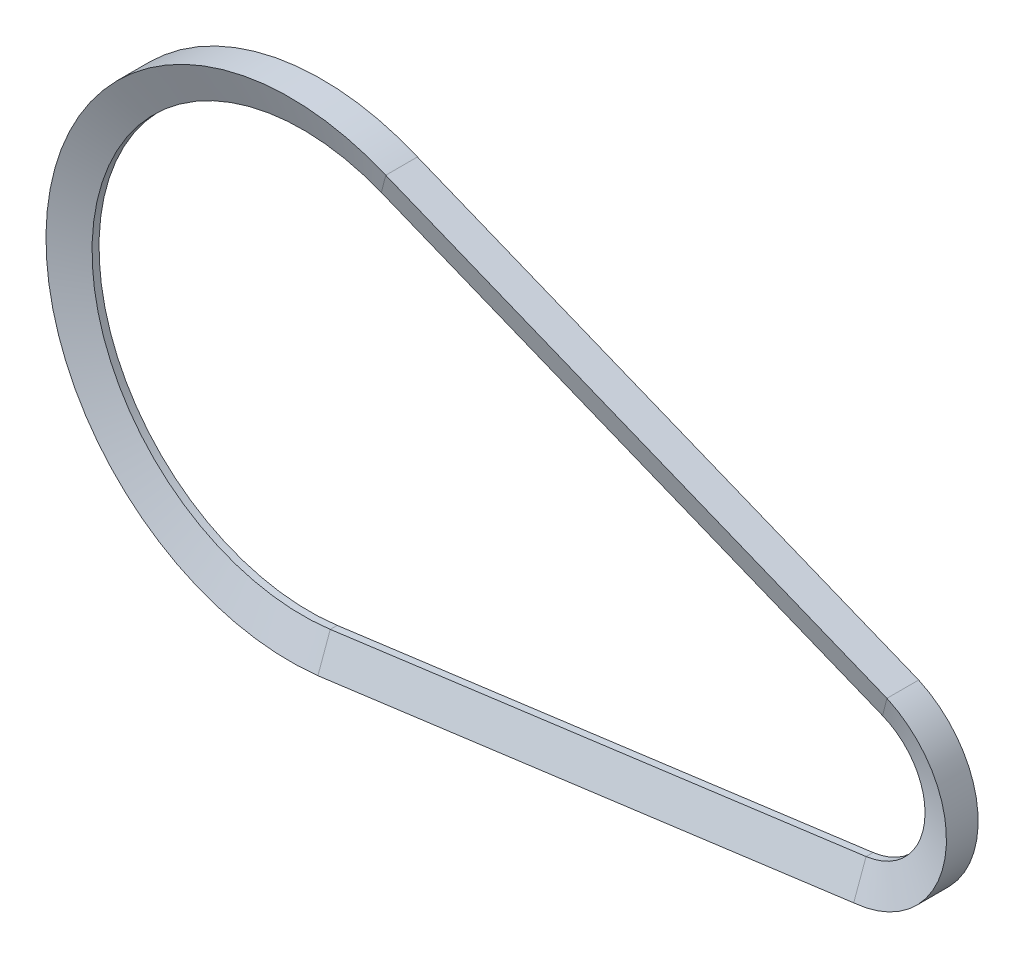
ISO-10303-21;
HEADER;
FILE_DESCRIPTION(('STEP AP214'),'2;1');
FILE_NAME('part.step','',(''),(''),'','','');
FILE_SCHEMA(('AUTOMOTIVE_DESIGN { 1 0 10303 214 1 1 1 1 }'));
ENDSEC;
DATA;
#1=APPLICATION_CONTEXT('core data for automotive mechanical design processes');
#2=APPLICATION_PROTOCOL_DEFINITION('international standard','automotive_design',2000,#1);
#3=PRODUCT_CONTEXT('',#1,'mechanical');
#4=PRODUCT('Part','Part','',(#3));
#5=PRODUCT_RELATED_PRODUCT_CATEGORY('part','',(#4));
#6=PRODUCT_DEFINITION_FORMATION('','',#4);
#7=PRODUCT_DEFINITION_CONTEXT('part definition',#1,'design');
#8=PRODUCT_DEFINITION('design','',#6,#7);
#9=PRODUCT_DEFINITION_SHAPE('','',#8);
#10=(LENGTH_UNIT() NAMED_UNIT(*) SI_UNIT(.MILLI.,.METRE.));
#11=(NAMED_UNIT(*) PLANE_ANGLE_UNIT() SI_UNIT($,.RADIAN.));
#12=(NAMED_UNIT(*) SI_UNIT($,.STERADIAN.) SOLID_ANGLE_UNIT());
#13=UNCERTAINTY_MEASURE_WITH_UNIT(LENGTH_MEASURE(1.E-05),#10,'distance_accuracy_value','');
#14=(GEOMETRIC_REPRESENTATION_CONTEXT(3) GLOBAL_UNCERTAINTY_ASSIGNED_CONTEXT((#13)) GLOBAL_UNIT_ASSIGNED_CONTEXT((#10,
#11,#12)) REPRESENTATION_CONTEXT('',''));
#15=CARTESIAN_POINT('',(0.,0.,0.));
#16=DIRECTION('',(0.,0.,1.));
#17=DIRECTION('',(1.,0.,0.));
#18=AXIS2_PLACEMENT_3D('',#15,#16,#17);
#19=CARTESIAN_POINT('',(124.475719306739,-30.3693151564213,0.770223243003508));
#20=DIRECTION('',(0.0453981297575215,-0.341667511459933,-0.93872377269743));
#21=DIRECTION('',(0.,0.93969262078591,-0.342020143325666));
#22=AXIS2_PLACEMENT_3D('',#19,#20,#21);
#23=PLANE('',#22);
#24=DIRECTION('',(0.,-0.939692620785909,0.342020143325666));
#25=VECTOR('',#24,1.);
#26=CARTESIAN_POINT('',(124.475719306739,-30.3693151564213,0.770223243003508));
#27=LINE('',#26,#25);
#28=CARTESIAN_POINT('',(124.475719306739,-30.3693151564213,0.770223243003508));
#29=VERTEX_POINT('',#28);
#30=CARTESIAN_POINT('',(124.475719306739,-37.8693151564213,3.5));
#31=VERTEX_POINT('',#30);
#32=EDGE_CURVE('E150',#29,#31,#27,.T.);
#33=ORIENTED_EDGE('',*,*,#32,.F.);
#34=DIRECTION('',(-0.991287677094754,-0.131714620449235,0.));
#35=VECTOR('',#34,1.);
#36=CARTESIAN_POINT('',(124.475719306739,-30.3693151564213,0.770223243003508));
#37=LINE('',#36,#35);
#38=CARTESIAN_POINT('',(6.12472985088943,-46.0948769849061,0.770223243003508));
#39=VERTEX_POINT('',#38);
#40=EDGE_CURVE('E149',#29,#39,#37,.T.);
#41=ORIENTED_EDGE('',*,*,#40,.T.);
#42=DIRECTION('',(0.,-0.939692620785909,0.342020143325666));
#43=VECTOR('',#42,1.);
#44=CARTESIAN_POINT('',(6.12472985088943,-46.0948769849061,0.770223243003508));
#45=LINE('',#44,#43);
#46=CARTESIAN_POINT('',(6.12472985088943,-53.5948769849061,3.5));
#47=VERTEX_POINT('',#46);
#48=EDGE_CURVE('E128',#39,#47,#45,.T.);
#49=ORIENTED_EDGE('',*,*,#48,.T.);
#50=DIRECTION('',(-0.991287677094754,-0.131714620449235,0.));
#51=VECTOR('',#50,1.);
#52=CARTESIAN_POINT('',(124.475719306739,-37.8693151564214,3.5));
#53=LINE('',#52,#51);
#54=EDGE_CURVE('E154',#31,#47,#53,.T.);
#55=ORIENTED_EDGE('',*,*,#54,.F.);
#56=EDGE_LOOP('',(#33,#41,#49,#55));
#57=FACE_BOUND('',#56,.T.);
#58=ADVANCED_FACE('F34',(#57),#23,.F.);
#59=CARTESIAN_POINT('',(6.12472985088943,-46.0948769849061,0.770223243003508));
#60=CARTESIAN_POINT('',(-26.763809279918,-50.4648510588701,0.770223243003508));
#61=CARTESIAN_POINT('',(-50.2969528979131,-27.0780207687135,0.770223243003508));
#62=CARTESIAN_POINT('',(-46.1321783681313,5.8371327731105,0.770223243003508));
#63=CARTESIAN_POINT('',(-41.9674038383495,38.7522863149345,0.770223243003508));
#64=CARTESIAN_POINT('',(-13.3508763277611,55.5405867888214,0.770223243003508));
#65=CARTESIAN_POINT('',(17.412721367423,43.1166688715686,0.770223243003508));
#66=CARTESIAN_POINT('',(6.12472985088943,-53.5948769849061,3.5));
#67=CARTESIAN_POINT('',(-32.1150339629088,-57.9648510588701,3.5));
#68=CARTESIAN_POINT('',(-58.9139401287493,-30.3388698408812,3.5));
#69=CARTESIAN_POINT('',(-53.3840209820254,7.75044892662746,3.5));
#70=CARTESIAN_POINT('',(-47.8541018353016,45.8397676941362,3.5));
#71=CARTESIAN_POINT('',(-14.3055621138431,64.7043295098772,3.5));
#72=CARTESIAN_POINT('',(21.1127393983367,49.6404612173529,3.5));
#73=(BOUNDED_SURFACE() B_SPLINE_SURFACE(1,3,((#59,#60,#61,#62,#63,#64,#65),(#66,#67,#68,#69,#70,
#71,#72)),.UNSPECIFIED.,.F.,.F.,.F.) B_SPLINE_SURFACE_WITH_KNOTS((2,2),(4,3,4),(0.,1.),(0.,0.5,
1.),.UNSPECIFIED.) GEOMETRIC_REPRESENTATION_ITEM() RATIONAL_B_SPLINE_SURFACE(((1.,
0.740188803038642,0.740188803038642,1.,0.740188803038642,0.740188803038642,1.),(1.,
0.740188803038642,0.740188803038642,1.,0.740188803038642,0.740188803038642,1.))) REPRESENTATION_ITEM('') SURFACE());
#74=CARTESIAN_POINT('',(0.,0.,3.5));
#75=DIRECTION('',(0.,0.,-1.));
#76=DIRECTION('',(0.113539290883504,-0.993533506946631,0.));
#77=AXIS2_PLACEMENT_3D('',#74,#75,#76);
#78=CIRCLE('',#77,53.94370356931);
#79=CARTESIAN_POINT('',(21.1127393983366,49.6404612173529,3.5));
#80=VERTEX_POINT('',#79);
#81=EDGE_CURVE('E118',#47,#80,#78,.T.);
#82=CARTESIAN_POINT('',(0.,0.,0.770223243003508));
#83=DIRECTION('',(0.,0.,-1.));
#84=DIRECTION('',(0.131714620449235,-0.991287677094754,0.));
#85=AXIS2_PLACEMENT_3D('',#82,#83,#84);
#86=CIRCLE('',#85,46.5);
#87=CARTESIAN_POINT('',(17.4127213674229,43.1166688715686,0.770223243003508));
#88=VERTEX_POINT('',#87);
#89=EDGE_CURVE('E131',#39,#88,#86,.T.);
#90=DIRECTION('',(0.463583952056587,0.817381270249745,0.342020143325666));
#91=VECTOR('',#90,1.);
#92=CARTESIAN_POINT('',(17.4127213674229,43.1166688715686,0.770223243003508));
#93=LINE('',#92,#91);
#94=EDGE_CURVE('E146',#88,#80,#93,.T.);
#95=ORIENTED_EDGE('',*,*,#81,.F.);
#96=ORIENTED_EDGE('',*,*,#48,.F.);
#97=ORIENTED_EDGE('',*,*,#89,.T.);
#98=ORIENTED_EDGE('',*,*,#94,.T.);
#99=EDGE_LOOP('',(#95,#96,#97,#98));
#100=FACE_BOUND('',#99,.T.);
#101=ADVANCED_FACE('F130',(#100),#73,.F.);
#102=CARTESIAN_POINT('',(0.,0.,0.));
#103=DIRECTION('',(0.,0.,-1.));
#104=DIRECTION('',(-1.,0.,0.));
#105=AXIS2_PLACEMENT_3D('',#102,#103,#104);
#106=CYLINDRICAL_SURFACE('',#105,53.94370356931);
#107=CARTESIAN_POINT('',(0.,0.,-3.5));
#108=DIRECTION('',(0.,0.,-1.));
#109=DIRECTION('',(0.113539290883504,-0.993533506946631,0.));
#110=AXIS2_PLACEMENT_3D('',#107,#108,#109);
#111=CIRCLE('',#110,53.94370356931);
#112=CARTESIAN_POINT('',(6.12472985088943,-53.5948769849061,-3.5));
#113=VERTEX_POINT('',#112);
#114=CARTESIAN_POINT('',(21.1127393983366,49.6404612173529,-3.5));
#115=VERTEX_POINT('',#114);
#116=EDGE_CURVE('E112',#113,#115,#111,.T.);
#117=ORIENTED_EDGE('',*,*,#116,.F.);
#118=DIRECTION('',(0.,0.,-1.));
#119=VECTOR('',#118,1.);
#120=CARTESIAN_POINT('',(6.12472985088943,-53.5948769849061,3.5));
#121=LINE('',#120,#119);
#122=EDGE_CURVE('E136',#47,#113,#121,.T.);
#123=ORIENTED_EDGE('',*,*,#122,.F.);
#124=ORIENTED_EDGE('',*,*,#81,.T.);
#125=DIRECTION('',(0.,0.,-1.));
#126=VECTOR('',#125,1.);
#127=CARTESIAN_POINT('',(21.1127393983366,49.6404612173529,3.5));
#128=LINE('',#127,#126);
#129=EDGE_CURVE('E187',#80,#115,#128,.T.);
#130=ORIENTED_EDGE('',*,*,#129,.T.);
#131=EDGE_LOOP('',(#117,#123,#124,#130));
#132=FACE_BOUND('',#131,.T.);
#133=ADVANCED_FACE('F213',(#132),#106,.T.);
#134=CARTESIAN_POINT('',(6.12472985088943,-53.5948769849061,-3.5));
#135=CARTESIAN_POINT('',(-32.1150339629088,-57.9648510588701,-3.5));
#136=CARTESIAN_POINT('',(-58.9139401287493,-30.3388698408812,-3.5));
#137=CARTESIAN_POINT('',(-53.3840209820254,7.75044892662746,-3.5));
#138=CARTESIAN_POINT('',(-47.8541018353016,45.8397676941362,-3.5));
#139=CARTESIAN_POINT('',(-14.3055621138431,64.7043295098772,-3.5));
#140=CARTESIAN_POINT('',(21.1127393983367,49.6404612173529,-3.5));
#141=CARTESIAN_POINT('',(6.12472985088943,-46.0948769849061,-0.770223243003508));
#142=CARTESIAN_POINT('',(-26.763809279918,-50.4648510588701,-0.770223243003508));
#143=CARTESIAN_POINT('',(-50.2969528979131,-27.0780207687135,-0.770223243003508));
#144=CARTESIAN_POINT('',(-46.1321783681313,5.8371327731105,-0.770223243003508));
#145=CARTESIAN_POINT('',(-41.9674038383495,38.7522863149345,-0.770223243003508));
#146=CARTESIAN_POINT('',(-13.3508763277611,55.5405867888214,-0.770223243003508));
#147=CARTESIAN_POINT('',(17.412721367423,43.1166688715686,-0.770223243003508));
#148=(BOUNDED_SURFACE() B_SPLINE_SURFACE(1,3,((#134,#135,#136,#137,#138,#139,#140),(#141,#142,
#143,#144,#145,#146,#147)),.UNSPECIFIED.,.F.,.F.,.F.) B_SPLINE_SURFACE_WITH_KNOTS((2,2),(4,3,4),
(0.,1.),(0.,0.5,1.),
.UNSPECIFIED.) GEOMETRIC_REPRESENTATION_ITEM() RATIONAL_B_SPLINE_SURFACE(((1.,0.740188803038642,
0.740188803038642,1.,0.740188803038642,0.740188803038642,1.),(1.,0.740188803038642,
0.740188803038642,1.,0.740188803038642,0.740188803038642,1.))) REPRESENTATION_ITEM('') SURFACE());
#149=CARTESIAN_POINT('',(0.,0.,-0.770223243003508));
#150=DIRECTION('',(0.,0.,-1.));
#151=DIRECTION('',(0.131714620449235,-0.991287677094754,0.));
#152=AXIS2_PLACEMENT_3D('',#149,#150,#151);
#153=CIRCLE('',#152,46.5);
#154=CARTESIAN_POINT('',(6.12472985088943,-46.0948769849061,-0.770223243003508));
#155=VERTEX_POINT('',#154);
#156=CARTESIAN_POINT('',(17.4127213674229,43.1166688715686,-0.770223243003508));
#157=VERTEX_POINT('',#156);
#158=EDGE_CURVE('E164',#155,#157,#153,.T.);
#159=DIRECTION('',(0.,0.939692620785909,0.342020143325666));
#160=VECTOR('',#159,1.);
#161=CARTESIAN_POINT('',(6.12472985088943,-53.5948769849061,-3.5));
#162=LINE('',#161,#160);
#163=EDGE_CURVE('E157',#113,#155,#162,.T.);
#164=DIRECTION('',(-0.463583952056587,-0.817381270249745,0.342020143325666));
#165=VECTOR('',#164,1.);
#166=CARTESIAN_POINT('',(21.1127393983366,49.6404612173529,-3.5));
#167=LINE('',#166,#165);
#168=EDGE_CURVE('E186',#115,#157,#167,.T.);
#169=ORIENTED_EDGE('',*,*,#158,.F.);
#170=ORIENTED_EDGE('',*,*,#163,.F.);
#171=ORIENTED_EDGE('',*,*,#116,.T.);
#172=ORIENTED_EDGE('',*,*,#168,.T.);
#173=EDGE_LOOP('',(#169,#170,#171,#172));
#174=FACE_BOUND('',#173,.T.);
#175=ADVANCED_FACE('F185',(#174),#148,.F.);
#176=CARTESIAN_POINT('',(0.,0.,0.));
#177=DIRECTION('',(0.,0.,-1.));
#178=DIRECTION('',(-1.,0.,0.));
#179=AXIS2_PLACEMENT_3D('',#176,#177,#178);
#180=CYLINDRICAL_SURFACE('',#179,46.5);
#181=DIRECTION('',(0.,0.,1.));
#182=VECTOR('',#181,1.);
#183=CARTESIAN_POINT('',(17.4127213674229,43.1166688715686,0.770223243003508));
#184=LINE('',#183,#182);
#185=EDGE_CURVE('E144',#157,#88,#184,.T.);
#186=ORIENTED_EDGE('',*,*,#185,.T.);
#187=ORIENTED_EDGE('',*,*,#89,.F.);
#188=DIRECTION('',(0.,0.,1.));
#189=VECTOR('',#188,1.);
#190=CARTESIAN_POINT('',(6.12472985088943,-46.0948769849061,0.770223243003508));
#191=LINE('',#190,#189);
#192=EDGE_CURVE('E143',#155,#39,#191,.T.);
#193=ORIENTED_EDGE('',*,*,#192,.F.);
#194=ORIENTED_EDGE('',*,*,#158,.T.);
#195=EDGE_LOOP('',(#186,#187,#193,#194));
#196=FACE_BOUND('',#195,.T.);
#197=ADVANCED_FACE('F141',(#196),#180,.F.);
#198=CARTESIAN_POINT('',(17.412721367423,43.1166688715686,0.770223243003508));
#199=DIRECTION('',(0.129067730873883,0.319592239298409,-0.93872377269743));
#200=DIRECTION('',(0.,0.946641691748174,0.322287926308379));
#201=AXIS2_PLACEMENT_3D('',#198,#199,#200);
#202=PLANE('',#201);
#203=DIRECTION('',(0.927240190786421,-0.374467126181139,0.));
#204=VECTOR('',#203,1.);
#205=CARTESIAN_POINT('',(21.1127393983367,49.6404612173529,3.5));
#206=LINE('',#205,#204);
#207=CARTESIAN_POINT('',(131.817024923631,4.93239520758056,3.5));
#208=VERTEX_POINT('',#207);
#209=EDGE_CURVE('E99',#80,#208,#206,.T.);
#210=ORIENTED_EDGE('',*,*,#209,.F.);
#211=ORIENTED_EDGE('',*,*,#94,.F.);
#212=DIRECTION('',(0.927240190786421,-0.374467126181139,0.));
#213=VECTOR('',#212,1.);
#214=CARTESIAN_POINT('',(17.412721367423,43.1166688715686,0.770223243003508));
#215=LINE('',#214,#213);
#216=CARTESIAN_POINT('',(128.117006892717,-1.59139713820371,0.770223243003508));
#217=VERTEX_POINT('',#216);
#218=EDGE_CURVE('E163',#88,#217,#215,.T.);
#219=ORIENTED_EDGE('',*,*,#218,.T.);
#220=DIRECTION('',(0.463583952056588,0.817381270249744,0.342020143325666));
#221=VECTOR('',#220,1.);
#222=CARTESIAN_POINT('',(128.117006892717,-1.5913971382037,0.770223243003508));
#223=LINE('',#222,#221);
#224=EDGE_CURVE('E172',#217,#208,#223,.T.);
#225=ORIENTED_EDGE('',*,*,#224,.T.);
#226=EDGE_LOOP('',(#210,#211,#219,#225));
#227=FACE_BOUND('',#226,.T.);
#228=ADVANCED_FACE('F209',(#227),#202,.F.);
#229=CARTESIAN_POINT('',(21.1127393983367,49.6404612173529,3.5));
#230=DIRECTION('',(-0.374467126181139,-0.927240190786421,0.));
#231=DIRECTION('',(0.927240190786421,-0.374467126181139,0.));
#232=AXIS2_PLACEMENT_3D('',#229,#230,#231);
#233=PLANE('',#232);
#234=DIRECTION('',(0.927240190786421,-0.374467126181139,0.));
#235=VECTOR('',#234,1.);
#236=CARTESIAN_POINT('',(21.1127393983367,49.6404612173529,-3.5));
#237=LINE('',#236,#235);
#238=CARTESIAN_POINT('',(131.817024923631,4.93239520758056,-3.5));
#239=VERTEX_POINT('',#238);
#240=EDGE_CURVE('E92',#115,#239,#237,.T.);
#241=ORIENTED_EDGE('',*,*,#240,.F.);
#242=ORIENTED_EDGE('',*,*,#129,.F.);
#243=ORIENTED_EDGE('',*,*,#209,.T.);
#244=DIRECTION('',(0.,0.,-1.));
#245=VECTOR('',#244,1.);
#246=CARTESIAN_POINT('',(131.817024923631,4.93239520758058,3.5));
#247=LINE('',#246,#245);
#248=EDGE_CURVE('E170',#208,#239,#247,.T.);
#249=ORIENTED_EDGE('',*,*,#248,.T.);
#250=EDGE_LOOP('',(#241,#242,#243,#249));
#251=FACE_BOUND('',#250,.T.);
#252=ADVANCED_FACE('F212',(#251),#233,.F.);
#253=CARTESIAN_POINT('',(21.1127393983367,49.6404612173529,-3.5));
#254=DIRECTION('',(0.129067730873883,0.319592239298409,0.938723772697429));
#255=DIRECTION('',(0.,-0.946641691748174,0.322287926308379));
#256=AXIS2_PLACEMENT_3D('',#253,#254,#255);
#257=PLANE('',#256);
#258=DIRECTION('',(0.927240190786421,-0.374467126181139,0.));
#259=VECTOR('',#258,1.);
#260=CARTESIAN_POINT('',(17.412721367423,43.1166688715686,-0.770223243003508));
#261=LINE('',#260,#259);
#262=CARTESIAN_POINT('',(128.117006892717,-1.59139713820371,-0.770223243003508));
#263=VERTEX_POINT('',#262);
#264=EDGE_CURVE('E83',#157,#263,#261,.T.);
#265=ORIENTED_EDGE('',*,*,#264,.F.);
#266=ORIENTED_EDGE('',*,*,#168,.F.);
#267=ORIENTED_EDGE('',*,*,#240,.T.);
#268=DIRECTION('',(-0.463583952056588,-0.817381270249744,0.342020143325666));
#269=VECTOR('',#268,1.);
#270=CARTESIAN_POINT('',(131.817024923631,4.93239520758058,-3.5));
#271=LINE('',#270,#269);
#272=EDGE_CURVE('E167',#239,#263,#271,.T.);
#273=ORIENTED_EDGE('',*,*,#272,.T.);
#274=EDGE_LOOP('',(#265,#266,#267,#273));
#275=FACE_BOUND('',#274,.T.);
#276=ADVANCED_FACE('F231',(#275),#257,.F.);
#277=CARTESIAN_POINT('',(17.412721367423,43.1166688715686,0.770223243003508));
#278=DIRECTION('',(0.374467126181139,0.927240190786421,0.));
#279=DIRECTION('',(-0.927240190786421,0.374467126181139,0.));
#280=AXIS2_PLACEMENT_3D('',#277,#278,#279);
#281=PLANE('',#280);
#282=DIRECTION('',(0.,0.,1.));
#283=VECTOR('',#282,1.);
#284=CARTESIAN_POINT('',(128.117006892717,-1.5913971382037,0.770223243003508));
#285=LINE('',#284,#283);
#286=EDGE_CURVE('E165',#263,#217,#285,.T.);
#287=ORIENTED_EDGE('',*,*,#286,.T.);
#288=ORIENTED_EDGE('',*,*,#218,.F.);
#289=ORIENTED_EDGE('',*,*,#185,.F.);
#290=ORIENTED_EDGE('',*,*,#264,.T.);
#291=EDGE_LOOP('',(#287,#288,#289,#290));
#292=FACE_BOUND('',#291,.T.);
#293=ADVANCED_FACE('F223',(#292),#281,.F.);
#294=CARTESIAN_POINT('',(128.117006892717,-1.59139713820367,0.770223243003508));
#295=CARTESIAN_POINT('',(145.926890042233,-8.78394101937953,0.770223243003508));
#296=CARTESIAN_POINT('',(143.51578882922,-27.8394183480289,0.770223243003508));
#297=CARTESIAN_POINT('',(124.475719306739,-30.3693151564213,0.770223243003508));
#298=CARTESIAN_POINT('',(131.817024923631,4.93239520758061,3.5));
#299=CARTESIAN_POINT('',(157.980585327767,-6.99799973142357,3.5));
#300=CARTESIAN_POINT('',(153.119494172499,-35.3394183480289,3.5));
#301=CARTESIAN_POINT('',(124.475719306738,-37.8693151564213,3.5));
#302=(BOUNDED_SURFACE() B_SPLINE_SURFACE(1,3,((#294,#295,#296,#297),(#298,#299,#300,#301)),
.UNSPECIFIED.,.F.,.F.,.F.) B_SPLINE_SURFACE_WITH_KNOTS((2,2),(4,4),(0.,1.),(0.,1.),
.UNSPECIFIED.) GEOMETRIC_REPRESENTATION_ITEM() RATIONAL_B_SPLINE_SURFACE(((1.,0.503405880312619,
0.503405880312619,1.),(1.,0.503405880312619,0.503405880312619,1.))) REPRESENTATION_ITEM('') SURFACE());
#303=CARTESIAN_POINT('',(122.5,-15.5,3.5));
#304=DIRECTION('',(0.,0.,-1.));
#305=DIRECTION('',(0.414894040337447,0.909869735342631,0.));
#306=AXIS2_PLACEMENT_3D('',#303,#304,#305);
#307=CIRCLE('',#306,22.4563961344273);
#308=EDGE_CURVE('E194',#208,#31,#307,.T.);
#309=CARTESIAN_POINT('',(122.5,-15.5,0.770223243003508));
#310=DIRECTION('',(0.,0.,-1.));
#311=DIRECTION('',(0.374467126181138,0.927240190786422,0.));
#312=AXIS2_PLACEMENT_3D('',#309,#310,#311);
#313=CIRCLE('',#312,15.);
#314=EDGE_CURVE('E166',#217,#29,#313,.T.);
#315=ORIENTED_EDGE('',*,*,#308,.F.);
#316=ORIENTED_EDGE('',*,*,#224,.F.);
#317=ORIENTED_EDGE('',*,*,#314,.T.);
#318=ORIENTED_EDGE('',*,*,#32,.T.);
#319=EDGE_LOOP('',(#315,#316,#317,#318));
#320=FACE_BOUND('',#319,.T.);
#321=ADVANCED_FACE('F221',(#320),#302,.F.);
#322=CARTESIAN_POINT('',(122.5,-15.5,0.));
#323=DIRECTION('',(0.,0.,-1.));
#324=DIRECTION('',(-1.,0.,0.));
#325=AXIS2_PLACEMENT_3D('',#322,#323,#324);
#326=CYLINDRICAL_SURFACE('',#325,22.4563961344273);
#327=CARTESIAN_POINT('',(122.5,-15.5,-3.5));
#328=DIRECTION('',(0.,0.,-1.));
#329=DIRECTION('',(0.414894040337447,0.909869735342631,0.));
#330=AXIS2_PLACEMENT_3D('',#327,#328,#329);
#331=CIRCLE('',#330,22.4563961344273);
#332=CARTESIAN_POINT('',(124.475719306739,-37.8693151564213,-3.5));
#333=VERTEX_POINT('',#332);
#334=EDGE_CURVE('E59',#239,#333,#331,.T.);
#335=ORIENTED_EDGE('',*,*,#334,.F.);
#336=ORIENTED_EDGE('',*,*,#248,.F.);
#337=ORIENTED_EDGE('',*,*,#308,.T.);
#338=DIRECTION('',(0.,0.,-1.));
#339=VECTOR('',#338,1.);
#340=CARTESIAN_POINT('',(124.475719306739,-37.8693151564213,3.5));
#341=LINE('',#340,#339);
#342=EDGE_CURVE('E192',#31,#333,#341,.T.);
#343=ORIENTED_EDGE('',*,*,#342,.T.);
#344=EDGE_LOOP('',(#335,#336,#337,#343));
#345=FACE_BOUND('',#344,.T.);
#346=ADVANCED_FACE('F218',(#345),#326,.T.);
#347=CARTESIAN_POINT('',(131.817024923631,4.93239520758061,-3.5));
#348=CARTESIAN_POINT('',(157.980585327767,-6.99799973142357,-3.5));
#349=CARTESIAN_POINT('',(153.119494172499,-35.3394183480289,-3.5));
#350=CARTESIAN_POINT('',(124.475719306738,-37.8693151564213,-3.5));
#351=CARTESIAN_POINT('',(128.117006892717,-1.59139713820367,-0.770223243003508));
#352=CARTESIAN_POINT('',(145.926890042233,-8.78394101937953,-0.770223243003508));
#353=CARTESIAN_POINT('',(143.51578882922,-27.8394183480289,-0.770223243003508));
#354=CARTESIAN_POINT('',(124.475719306739,-30.3693151564213,-0.770223243003508));
#355=(BOUNDED_SURFACE() B_SPLINE_SURFACE(1,3,((#347,#348,#349,#350),(#351,#352,#353,#354)),
.UNSPECIFIED.,.F.,.F.,.F.) B_SPLINE_SURFACE_WITH_KNOTS((2,2),(4,4),(0.,1.),(0.,1.),
.UNSPECIFIED.) GEOMETRIC_REPRESENTATION_ITEM() RATIONAL_B_SPLINE_SURFACE(((1.,0.503405880312619,
0.503405880312619,1.),(1.,0.503405880312619,0.503405880312619,1.))) REPRESENTATION_ITEM('') SURFACE());
#356=CARTESIAN_POINT('',(122.5,-15.5,-0.770223243003508));
#357=DIRECTION('',(0.,0.,-1.));
#358=DIRECTION('',(0.374467126181138,0.927240190786422,0.));
#359=AXIS2_PLACEMENT_3D('',#356,#357,#358);
#360=CIRCLE('',#359,15.);
#361=CARTESIAN_POINT('',(124.475719306739,-30.3693151564213,-0.770223243003508));
#362=VERTEX_POINT('',#361);
#363=EDGE_CURVE('E51',#263,#362,#360,.T.);
#364=DIRECTION('',(0.,0.939692620785909,0.342020143325666));
#365=VECTOR('',#364,1.);
#366=CARTESIAN_POINT('',(124.475719306739,-37.8693151564213,-3.5));
#367=LINE('',#366,#365);
#368=EDGE_CURVE('E178',#333,#362,#367,.T.);
#369=ORIENTED_EDGE('',*,*,#363,.F.);
#370=ORIENTED_EDGE('',*,*,#272,.F.);
#371=ORIENTED_EDGE('',*,*,#334,.T.);
#372=ORIENTED_EDGE('',*,*,#368,.T.);
#373=EDGE_LOOP('',(#369,#370,#371,#372));
#374=FACE_BOUND('',#373,.T.);
#375=ADVANCED_FACE('F229',(#374),#355,.F.);
#376=CARTESIAN_POINT('',(122.5,-15.5,0.));
#377=DIRECTION('',(0.,0.,-1.));
#378=DIRECTION('',(-1.,0.,0.));
#379=AXIS2_PLACEMENT_3D('',#376,#377,#378);
#380=CYLINDRICAL_SURFACE('',#379,15.);
#381=DIRECTION('',(0.,0.,1.));
#382=VECTOR('',#381,1.);
#383=CARTESIAN_POINT('',(124.475719306739,-30.3693151564213,0.770223243003508));
#384=LINE('',#383,#382);
#385=EDGE_CURVE('E38',#362,#29,#384,.T.);
#386=ORIENTED_EDGE('',*,*,#385,.T.);
#387=ORIENTED_EDGE('',*,*,#314,.F.);
#388=ORIENTED_EDGE('',*,*,#286,.F.);
#389=ORIENTED_EDGE('',*,*,#363,.T.);
#390=EDGE_LOOP('',(#386,#387,#388,#389));
#391=FACE_BOUND('',#390,.T.);
#392=ADVANCED_FACE('F179',(#391),#380,.F.);
#393=CARTESIAN_POINT('',(124.475719306739,-37.8693151564214,3.5));
#394=DIRECTION('',(-0.131714620449235,0.991287677094754,0.));
#395=DIRECTION('',(-0.991287677094755,-0.131714620449235,0.));
#396=AXIS2_PLACEMENT_3D('',#393,#394,#395);
#397=PLANE('',#396);
#398=ORIENTED_EDGE('',*,*,#54,.T.);
#399=ORIENTED_EDGE('',*,*,#122,.T.);
#400=DIRECTION('',(-0.991287677094754,-0.131714620449235,0.));
#401=VECTOR('',#400,1.);
#402=CARTESIAN_POINT('',(124.475719306739,-37.8693151564214,-3.5));
#403=LINE('',#402,#401);
#404=EDGE_CURVE('E43',#333,#113,#403,.T.);
#405=ORIENTED_EDGE('',*,*,#404,.F.);
#406=ORIENTED_EDGE('',*,*,#342,.F.);
#407=EDGE_LOOP('',(#398,#399,#405,#406));
#408=FACE_BOUND('',#407,.T.);
#409=ADVANCED_FACE('F215',(#408),#397,.F.);
#410=CARTESIAN_POINT('',(124.475719306739,-37.8693151564214,-3.5));
#411=DIRECTION('',(0.0453981297575216,-0.341667511459934,0.938723772697429));
#412=DIRECTION('',(0.,-0.93969262078591,-0.342020143325666));
#413=AXIS2_PLACEMENT_3D('',#410,#411,#412);
#414=PLANE('',#413);
#415=ORIENTED_EDGE('',*,*,#404,.T.);
#416=ORIENTED_EDGE('',*,*,#163,.T.);
#417=DIRECTION('',(-0.991287677094754,-0.131714620449235,0.));
#418=VECTOR('',#417,1.);
#419=CARTESIAN_POINT('',(124.475719306739,-30.3693151564213,-0.770223243003508));
#420=LINE('',#419,#418);
#421=EDGE_CURVE('E11',#362,#155,#420,.T.);
#422=ORIENTED_EDGE('',*,*,#421,.F.);
#423=ORIENTED_EDGE('',*,*,#368,.F.);
#424=EDGE_LOOP('',(#415,#416,#422,#423));
#425=FACE_BOUND('',#424,.T.);
#426=ADVANCED_FACE('F183',(#425),#414,.F.);
#427=CARTESIAN_POINT('',(124.475719306739,-30.3693151564213,0.770223243003508));
#428=DIRECTION('',(0.131714620449235,-0.991287677094754,0.));
#429=DIRECTION('',(0.991287677094755,0.131714620449235,0.));
#430=AXIS2_PLACEMENT_3D('',#427,#428,#429);
#431=PLANE('',#430);
#432=ORIENTED_EDGE('',*,*,#421,.T.);
#433=ORIENTED_EDGE('',*,*,#192,.T.);
#434=ORIENTED_EDGE('',*,*,#40,.F.);
#435=ORIENTED_EDGE('',*,*,#385,.F.);
#436=EDGE_LOOP('',(#432,#433,#434,#435));
#437=FACE_BOUND('',#436,.T.);
#438=ADVANCED_FACE('F36',(#437),#431,.F.);
#439=CLOSED_SHELL('',(#58,#101,#133,#175,#197,#228,#252,#276,#293,#321,#346,#375,#392,#409,#426,#438));
#440=MANIFOLD_SOLID_BREP('B2',#439);
#441=ADVANCED_BREP_SHAPE_REPRESENTATION('',(#18,#440),#14);
#442=SHAPE_DEFINITION_REPRESENTATION(#9,#441);
ENDSEC;
END-ISO-10303-21;
